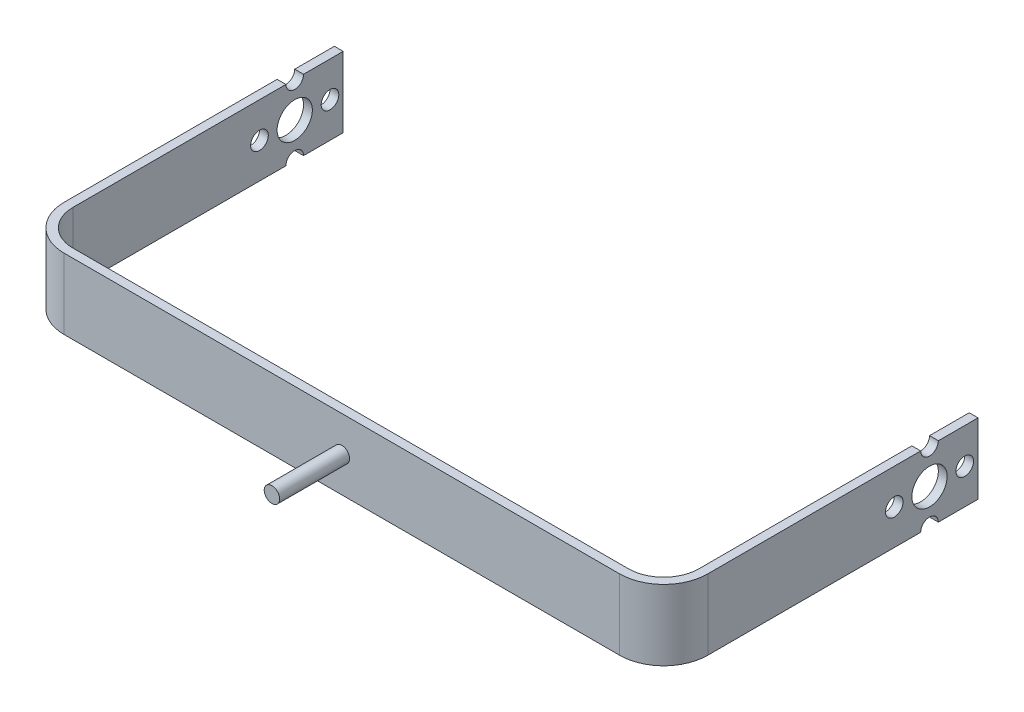
ISO-10303-21;
HEADER;
FILE_DESCRIPTION(('STEP AP214'),'2;1');
FILE_NAME('part.step','',(''),(''),'','','');
FILE_SCHEMA(('AUTOMOTIVE_DESIGN { 1 0 10303 214 1 1 1 1 }'));
ENDSEC;
DATA;
#1=APPLICATION_CONTEXT('core data for automotive mechanical design processes');
#2=APPLICATION_PROTOCOL_DEFINITION('international standard','automotive_design',2000,#1);
#3=PRODUCT_CONTEXT('',#1,'mechanical');
#4=PRODUCT('Part','Part','',(#3));
#5=PRODUCT_RELATED_PRODUCT_CATEGORY('part','',(#4));
#6=PRODUCT_DEFINITION_FORMATION('','',#4);
#7=PRODUCT_DEFINITION_CONTEXT('part definition',#1,'design');
#8=PRODUCT_DEFINITION('design','',#6,#7);
#9=PRODUCT_DEFINITION_SHAPE('','',#8);
#10=(LENGTH_UNIT() NAMED_UNIT(*) SI_UNIT(.MILLI.,.METRE.));
#11=(NAMED_UNIT(*) PLANE_ANGLE_UNIT() SI_UNIT($,.RADIAN.));
#12=(NAMED_UNIT(*) SI_UNIT($,.STERADIAN.) SOLID_ANGLE_UNIT());
#13=UNCERTAINTY_MEASURE_WITH_UNIT(LENGTH_MEASURE(1.E-05),#10,'distance_accuracy_value','');
#14=(GEOMETRIC_REPRESENTATION_CONTEXT(3) GLOBAL_UNCERTAINTY_ASSIGNED_CONTEXT((#13)) GLOBAL_UNIT_ASSIGNED_CONTEXT((#10,
#11,#12)) REPRESENTATION_CONTEXT('',''));
#15=CARTESIAN_POINT('',(0.,0.,0.));
#16=DIRECTION('',(0.,0.,1.));
#17=DIRECTION('',(1.,0.,0.));
#18=AXIS2_PLACEMENT_3D('',#15,#16,#17);
#19=CARTESIAN_POINT('',(144.05,16.,1.99999999999998));
#20=DIRECTION('',(0.,0.,-1.));
#21=DIRECTION('',(-1.,0.,0.));
#22=AXIS2_PLACEMENT_3D('',#19,#20,#21);
#23=PLANE('',#22);
#24=DIRECTION('',(1.,0.,0.));
#25=VECTOR('',#24,1.);
#26=CARTESIAN_POINT('',(144.05,16.,1.99999999999998));
#27=LINE('',#26,#25);
#28=CARTESIAN_POINT('',(8.00000000000001,16.,1.99999999999999));
#29=VERTEX_POINT('',#28);
#30=CARTESIAN_POINT('',(134.05,16.,1.99999999999998));
#31=VERTEX_POINT('',#30);
#32=EDGE_CURVE('E196',#29,#31,#27,.T.);
#33=ORIENTED_EDGE('',*,*,#32,.F.);
#34=DIRECTION('',(0.,-1.,0.));
#35=VECTOR('',#34,1.);
#36=CARTESIAN_POINT('',(8.00000000000001,16.,1.99999999999999));
#37=LINE('',#36,#35);
#38=CARTESIAN_POINT('',(8.00000000000001,0.,1.99999999999999));
#39=VERTEX_POINT('',#38);
#40=EDGE_CURVE('E267',#29,#39,#37,.T.);
#41=ORIENTED_EDGE('',*,*,#40,.T.);
#42=DIRECTION('',(1.,0.,0.));
#43=VECTOR('',#42,1.);
#44=CARTESIAN_POINT('',(144.05,0.,1.99999999999998));
#45=LINE('',#44,#43);
#46=CARTESIAN_POINT('',(134.05,0.,1.99999999999998));
#47=VERTEX_POINT('',#46);
#48=EDGE_CURVE('E217',#39,#47,#45,.T.);
#49=ORIENTED_EDGE('',*,*,#48,.T.);
#50=DIRECTION('',(0.,-1.,0.));
#51=VECTOR('',#50,1.);
#52=CARTESIAN_POINT('',(134.05,16.,1.99999999999998));
#53=LINE('',#52,#51);
#54=EDGE_CURVE('E265',#47,#31,#53,.F.);
#55=ORIENTED_EDGE('',*,*,#54,.T.);
#56=EDGE_LOOP('',(#33,#41,#49,#55));
#57=FACE_BOUND('',#56,.T.);
#58=CARTESIAN_POINT('',(71.025,8.,1.99999999999999));
#59=DIRECTION('',(0.,0.,-1.));
#60=DIRECTION('',(-1.,0.,0.));
#61=AXIS2_PLACEMENT_3D('',#58,#59,#60);
#62=CIRCLE('',#61,1.75);
#63=CARTESIAN_POINT('',(69.275,8.,1.99999999999999));
#64=VERTEX_POINT('',#63);
#65=EDGE_CURVE('E11',#64,#64,#62,.F.);
#66=ORIENTED_EDGE('',*,*,#65,.F.);
#67=EDGE_LOOP('',(#66));
#68=FACE_BOUND('',#67,.T.);
#69=ADVANCED_FACE('F32',(#57,#68),#23,.F.);
#70=CARTESIAN_POINT('',(0.,16.,0.));
#71=DIRECTION('',(0.,1.,0.));
#72=DIRECTION('',(0.,0.,1.));
#73=AXIS2_PLACEMENT_3D('',#70,#71,#72);
#74=PLANE('',#73);
#75=DIRECTION('',(1.,0.,0.));
#76=VECTOR('',#75,1.);
#77=CARTESIAN_POINT('',(-2.,16.,-56.3249999999999));
#78=LINE('',#77,#76);
#79=CARTESIAN_POINT('',(-2.,16.,-56.3249999999999));
#80=VERTEX_POINT('',#79);
#81=CARTESIAN_POINT('',(0.,16.,-56.3249999999999));
#82=VERTEX_POINT('',#81);
#83=EDGE_CURVE('E40',#80,#82,#78,.T.);
#84=ORIENTED_EDGE('',*,*,#83,.F.);
#85=DIRECTION('',(0.,0.,1.));
#86=VECTOR('',#85,1.);
#87=CARTESIAN_POINT('',(-2.,16.,2.));
#88=LINE('',#87,#86);
#89=CARTESIAN_POINT('',(-2.,16.,-8.00000000000001));
#90=VERTEX_POINT('',#89);
#91=EDGE_CURVE('E368',#80,#90,#88,.T.);
#92=ORIENTED_EDGE('',*,*,#91,.T.);
#93=CARTESIAN_POINT('',(8.00000000000001,16.,-8.00000000000001));
#94=DIRECTION('',(0.,1.,0.));
#95=DIRECTION('',(0.,0.,1.));
#96=AXIS2_PLACEMENT_3D('',#93,#94,#95);
#97=CIRCLE('',#96,10.);
#98=EDGE_CURVE('E279',#90,#29,#97,.T.);
#99=ORIENTED_EDGE('',*,*,#98,.T.);
#100=ORIENTED_EDGE('',*,*,#32,.T.);
#101=CARTESIAN_POINT('',(134.05,16.,-8.00000000000002));
#102=DIRECTION('',(0.,1.,0.));
#103=DIRECTION('',(0.,0.,1.));
#104=AXIS2_PLACEMENT_3D('',#101,#102,#103);
#105=CIRCLE('',#104,10.);
#106=CARTESIAN_POINT('',(144.05,16.,-8.00000000000002));
#107=VERTEX_POINT('',#106);
#108=EDGE_CURVE('E191',#31,#107,#105,.T.);
#109=ORIENTED_EDGE('',*,*,#108,.T.);
#110=DIRECTION('',(0.,0.,-1.));
#111=VECTOR('',#110,1.);
#112=CARTESIAN_POINT('',(144.05,16.,-69.325));
#113=LINE('',#112,#111);
#114=CARTESIAN_POINT('',(144.05,16.,-56.3249999999999));
#115=VERTEX_POINT('',#114);
#116=EDGE_CURVE('E180',#107,#115,#113,.T.);
#117=ORIENTED_EDGE('',*,*,#116,.T.);
#118=CARTESIAN_POINT('',(142.05,16.,-56.3249999999999));
#119=VERTEX_POINT('',#118);
#120=EDGE_CURVE('E167',#119,#115,#78,.T.);
#121=ORIENTED_EDGE('',*,*,#120,.F.);
#122=DIRECTION('',(0.,0.,1.));
#123=VECTOR('',#122,1.);
#124=CARTESIAN_POINT('',(142.05,16.,0.));
#125=LINE('',#124,#123);
#126=CARTESIAN_POINT('',(142.05,16.,-8.));
#127=VERTEX_POINT('',#126);
#128=EDGE_CURVE('E194',#119,#127,#125,.T.);
#129=ORIENTED_EDGE('',*,*,#128,.T.);
#130=CARTESIAN_POINT('',(134.05,16.,-8.));
#131=DIRECTION('',(0.,1.,0.));
#132=DIRECTION('',(0.,0.,1.));
#133=AXIS2_PLACEMENT_3D('',#130,#131,#132);
#134=CIRCLE('',#133,8.);
#135=CARTESIAN_POINT('',(134.05,16.,0.));
#136=VERTEX_POINT('',#135);
#137=EDGE_CURVE('E259',#127,#136,#134,.F.);
#138=ORIENTED_EDGE('',*,*,#137,.T.);
#139=DIRECTION('',(-1.,0.,0.));
#140=VECTOR('',#139,1.);
#141=CARTESIAN_POINT('',(0.,16.,0.));
#142=LINE('',#141,#140);
#143=CARTESIAN_POINT('',(8.,16.,0.));
#144=VERTEX_POINT('',#143);
#145=EDGE_CURVE('E203',#136,#144,#142,.T.);
#146=ORIENTED_EDGE('',*,*,#145,.T.);
#147=CARTESIAN_POINT('',(8.,16.,-8.));
#148=DIRECTION('',(0.,1.,0.));
#149=DIRECTION('',(0.,0.,1.));
#150=AXIS2_PLACEMENT_3D('',#147,#148,#149);
#151=CIRCLE('',#150,8.);
#152=CARTESIAN_POINT('',(0.,16.,-8.));
#153=VERTEX_POINT('',#152);
#154=EDGE_CURVE('E263',#144,#153,#151,.F.);
#155=ORIENTED_EDGE('',*,*,#154,.T.);
#156=DIRECTION('',(0.,0.,-1.));
#157=VECTOR('',#156,1.);
#158=CARTESIAN_POINT('',(0.,16.,-69.325));
#159=LINE('',#158,#157);
#160=EDGE_CURVE('E324',#153,#82,#159,.T.);
#161=ORIENTED_EDGE('',*,*,#160,.T.);
#162=EDGE_LOOP('',(#84,#92,#99,#100,#109,#117,#121,#129,#138,#146,#155,#161));
#163=FACE_BOUND('',#162,.T.);
#164=ADVANCED_FACE('F188',(#163),#74,.T.);
#165=DIRECTION('',(1.,0.,0.));
#166=VECTOR('',#165,1.);
#167=CARTESIAN_POINT('',(-2.,16.,-60.3249999999999));
#168=LINE('',#167,#166);
#169=CARTESIAN_POINT('',(144.05,16.,-60.3249999999999));
#170=VERTEX_POINT('',#169);
#171=CARTESIAN_POINT('',(142.05,16.,-60.3249999999999));
#172=VERTEX_POINT('',#171);
#173=EDGE_CURVE('E174',#170,#172,#168,.F.);
#174=ORIENTED_EDGE('',*,*,#173,.F.);
#175=CARTESIAN_POINT('',(144.05,16.,-69.325));
#176=VERTEX_POINT('',#175);
#177=EDGE_CURVE('E183',#170,#176,#113,.T.);
#178=ORIENTED_EDGE('',*,*,#177,.T.);
#179=DIRECTION('',(-1.,0.,0.));
#180=VECTOR('',#179,1.);
#181=CARTESIAN_POINT('',(142.05,16.,-69.325));
#182=LINE('',#181,#180);
#183=CARTESIAN_POINT('',(142.05,16.,-69.325));
#184=VERTEX_POINT('',#183);
#185=EDGE_CURVE('E192',#176,#184,#182,.T.);
#186=ORIENTED_EDGE('',*,*,#185,.T.);
#187=EDGE_CURVE('E200',#184,#172,#125,.T.);
#188=ORIENTED_EDGE('',*,*,#187,.T.);
#189=EDGE_LOOP('',(#174,#178,#186,#188));
#190=FACE_BOUND('',#189,.T.);
#191=ADVANCED_FACE('F399',(#190),#74,.T.);
#192=CARTESIAN_POINT('',(0.,0.,0.));
#193=DIRECTION('',(0.,1.,0.));
#194=DIRECTION('',(0.,0.,1.));
#195=AXIS2_PLACEMENT_3D('',#192,#193,#194);
#196=PLANE('',#195);
#197=DIRECTION('',(0.,0.,1.));
#198=VECTOR('',#197,1.);
#199=CARTESIAN_POINT('',(-2.,0.,2.));
#200=LINE('',#199,#198);
#201=CARTESIAN_POINT('',(-2.,0.,-56.3250000000002));
#202=VERTEX_POINT('',#201);
#203=CARTESIAN_POINT('',(-2.,0.,-8.00000000000001));
#204=VERTEX_POINT('',#203);
#205=EDGE_CURVE('E213',#202,#204,#200,.T.);
#206=ORIENTED_EDGE('',*,*,#205,.F.);
#207=DIRECTION('',(1.,0.,0.));
#208=VECTOR('',#207,1.);
#209=CARTESIAN_POINT('',(-2.,0.,-56.3250000000002));
#210=LINE('',#209,#208);
#211=CARTESIAN_POINT('',(0.,0.,-56.3250000000002));
#212=VERTEX_POINT('',#211);
#213=EDGE_CURVE('E300',#202,#212,#210,.T.);
#214=ORIENTED_EDGE('',*,*,#213,.T.);
#215=DIRECTION('',(0.,0.,-1.));
#216=VECTOR('',#215,1.);
#217=CARTESIAN_POINT('',(0.,0.,-69.325));
#218=LINE('',#217,#216);
#219=CARTESIAN_POINT('',(0.,0.,-8.));
#220=VERTEX_POINT('',#219);
#221=EDGE_CURVE('E207',#220,#212,#218,.T.);
#222=ORIENTED_EDGE('',*,*,#221,.F.);
#223=CARTESIAN_POINT('',(8.,0.,-8.));
#224=DIRECTION('',(0.,1.,0.));
#225=DIRECTION('',(0.,0.,1.));
#226=AXIS2_PLACEMENT_3D('',#223,#224,#225);
#227=CIRCLE('',#226,8.);
#228=CARTESIAN_POINT('',(8.,0.,0.));
#229=VERTEX_POINT('',#228);
#230=EDGE_CURVE('E261',#220,#229,#227,.T.);
#231=ORIENTED_EDGE('',*,*,#230,.T.);
#232=DIRECTION('',(-1.,0.,0.));
#233=VECTOR('',#232,1.);
#234=CARTESIAN_POINT('',(0.,0.,0.));
#235=LINE('',#234,#233);
#236=CARTESIAN_POINT('',(134.05,0.,0.));
#237=VERTEX_POINT('',#236);
#238=EDGE_CURVE('E230',#237,#229,#235,.T.);
#239=ORIENTED_EDGE('',*,*,#238,.F.);
#240=CARTESIAN_POINT('',(134.05,0.,-8.));
#241=DIRECTION('',(0.,1.,0.));
#242=DIRECTION('',(0.,0.,1.));
#243=AXIS2_PLACEMENT_3D('',#240,#241,#242);
#244=CIRCLE('',#243,8.);
#245=CARTESIAN_POINT('',(142.05,0.,-8.));
#246=VERTEX_POINT('',#245);
#247=EDGE_CURVE('E256',#237,#246,#244,.T.);
#248=ORIENTED_EDGE('',*,*,#247,.T.);
#249=DIRECTION('',(0.,0.,1.));
#250=VECTOR('',#249,1.);
#251=CARTESIAN_POINT('',(142.05,0.,0.));
#252=LINE('',#251,#250);
#253=CARTESIAN_POINT('',(142.05,0.,-56.3250000000002));
#254=VERTEX_POINT('',#253);
#255=EDGE_CURVE('E226',#254,#246,#252,.T.);
#256=ORIENTED_EDGE('',*,*,#255,.F.);
#257=CARTESIAN_POINT('',(144.05,0.,-56.3250000000002));
#258=VERTEX_POINT('',#257);
#259=EDGE_CURVE('E297',#254,#258,#210,.T.);
#260=ORIENTED_EDGE('',*,*,#259,.T.);
#261=DIRECTION('',(0.,0.,-1.));
#262=VECTOR('',#261,1.);
#263=CARTESIAN_POINT('',(144.05,0.,-69.325));
#264=LINE('',#263,#262);
#265=CARTESIAN_POINT('',(144.05,0.,-8.00000000000002));
#266=VERTEX_POINT('',#265);
#267=EDGE_CURVE('E221',#266,#258,#264,.T.);
#268=ORIENTED_EDGE('',*,*,#267,.F.);
#269=CARTESIAN_POINT('',(134.05,0.,-8.00000000000002));
#270=DIRECTION('',(0.,1.,0.));
#271=DIRECTION('',(0.,0.,1.));
#272=AXIS2_PLACEMENT_3D('',#269,#270,#271);
#273=CIRCLE('',#272,10.);
#274=EDGE_CURVE('E270',#266,#47,#273,.F.);
#275=ORIENTED_EDGE('',*,*,#274,.T.);
#276=ORIENTED_EDGE('',*,*,#48,.F.);
#277=CARTESIAN_POINT('',(8.00000000000001,0.,-8.00000000000001));
#278=DIRECTION('',(0.,1.,0.));
#279=DIRECTION('',(0.,0.,1.));
#280=AXIS2_PLACEMENT_3D('',#277,#278,#279);
#281=CIRCLE('',#280,10.);
#282=EDGE_CURVE('E272',#39,#204,#281,.F.);
#283=ORIENTED_EDGE('',*,*,#282,.T.);
#284=EDGE_LOOP('',(#206,#214,#222,#231,#239,#248,#256,#260,#268,#275,#276,#283));
#285=FACE_BOUND('',#284,.T.);
#286=ADVANCED_FACE('F312',(#285),#196,.F.);
#287=CARTESIAN_POINT('',(144.05,0.,-60.3250000000002));
#288=VERTEX_POINT('',#287);
#289=CARTESIAN_POINT('',(144.05,0.,-69.325));
#290=VERTEX_POINT('',#289);
#291=EDGE_CURVE('E220',#288,#290,#264,.T.);
#292=ORIENTED_EDGE('',*,*,#291,.F.);
#293=DIRECTION('',(1.,0.,0.));
#294=VECTOR('',#293,1.);
#295=CARTESIAN_POINT('',(-2.,0.,-60.3250000000002));
#296=LINE('',#295,#294);
#297=CARTESIAN_POINT('',(142.05,0.,-60.3250000000002));
#298=VERTEX_POINT('',#297);
#299=EDGE_CURVE('E296',#288,#298,#296,.F.);
#300=ORIENTED_EDGE('',*,*,#299,.T.);
#301=CARTESIAN_POINT('',(142.05,0.,-69.325));
#302=VERTEX_POINT('',#301);
#303=EDGE_CURVE('E227',#302,#298,#252,.T.);
#304=ORIENTED_EDGE('',*,*,#303,.F.);
#305=DIRECTION('',(-1.,0.,0.));
#306=VECTOR('',#305,1.);
#307=CARTESIAN_POINT('',(142.05,0.,-69.325));
#308=LINE('',#307,#306);
#309=EDGE_CURVE('E224',#290,#302,#308,.T.);
#310=ORIENTED_EDGE('',*,*,#309,.F.);
#311=EDGE_LOOP('',(#292,#300,#304,#310));
#312=FACE_BOUND('',#311,.T.);
#313=ADVANCED_FACE('F392',(#312),#196,.F.);
#314=CARTESIAN_POINT('',(0.,16.,-69.325));
#315=DIRECTION('',(-1.,0.,0.));
#316=DIRECTION('',(0.,0.,1.));
#317=AXIS2_PLACEMENT_3D('',#314,#315,#316);
#318=PLANE('',#317);
#319=CARTESIAN_POINT('',(0.,7.99999999999961,-50.325));
#320=DIRECTION('',(-1.,0.,0.));
#321=DIRECTION('',(0.,0.,1.));
#322=AXIS2_PLACEMENT_3D('',#319,#320,#321);
#323=CIRCLE('',#322,1.99999999999999);
#324=CARTESIAN_POINT('',(0.,7.99999999999961,-48.325));
#325=VERTEX_POINT('',#324);
#326=EDGE_CURVE('E304',#325,#325,#323,.T.);
#327=ORIENTED_EDGE('',*,*,#326,.T.);
#328=EDGE_LOOP('',(#327));
#329=FACE_BOUND('',#328,.T.);
#330=CARTESIAN_POINT('',(0.,8.,-66.325));
#331=DIRECTION('',(-1.,0.,0.));
#332=DIRECTION('',(0.,0.,1.));
#333=AXIS2_PLACEMENT_3D('',#330,#331,#332);
#334=CIRCLE('',#333,2.);
#335=CARTESIAN_POINT('',(0.,8.,-64.325));
#336=VERTEX_POINT('',#335);
#337=EDGE_CURVE('E292',#336,#336,#334,.T.);
#338=ORIENTED_EDGE('',*,*,#337,.T.);
#339=EDGE_LOOP('',(#338));
#340=FACE_BOUND('',#339,.T.);
#341=CARTESIAN_POINT('',(0.,8.,-58.325));
#342=DIRECTION('',(-1.,0.,0.));
#343=DIRECTION('',(0.,0.,1.));
#344=AXIS2_PLACEMENT_3D('',#341,#342,#343);
#345=CIRCLE('',#344,4.);
#346=CARTESIAN_POINT('',(0.,8.,-54.325));
#347=VERTEX_POINT('',#346);
#348=EDGE_CURVE('E287',#347,#347,#345,.T.);
#349=ORIENTED_EDGE('',*,*,#348,.T.);
#350=EDGE_LOOP('',(#349));
#351=FACE_BOUND('',#350,.T.);
#352=CARTESIAN_POINT('',(0.,16.,-60.3249999999999));
#353=VERTEX_POINT('',#352);
#354=CARTESIAN_POINT('',(0.,16.,-69.325));
#355=VERTEX_POINT('',#354);
#356=EDGE_CURVE('E233',#353,#355,#159,.T.);
#357=ORIENTED_EDGE('',*,*,#356,.F.);
#358=CARTESIAN_POINT('',(0.,15.9999999999998,-58.3249999999999));
#359=DIRECTION('',(-1.,0.,0.));
#360=DIRECTION('',(0.,0.,1.));
#361=AXIS2_PLACEMENT_3D('',#358,#359,#360);
#362=CIRCLE('',#361,1.99999999999999);
#363=EDGE_CURVE('E47',#353,#82,#362,.T.);
#364=ORIENTED_EDGE('',*,*,#363,.T.);
#365=ORIENTED_EDGE('',*,*,#160,.F.);
#366=DIRECTION('',(0.,-1.,0.));
#367=VECTOR('',#366,1.);
#368=CARTESIAN_POINT('',(0.,0.,-8.));
#369=LINE('',#368,#367);
#370=EDGE_CURVE('E253',#153,#220,#369,.T.);
#371=ORIENTED_EDGE('',*,*,#370,.T.);
#372=ORIENTED_EDGE('',*,*,#221,.T.);
#373=CARTESIAN_POINT('',(0.,-2.22044604925031E-13,-58.3250000000002));
#374=DIRECTION('',(-1.,0.,0.));
#375=DIRECTION('',(0.,0.,1.));
#376=AXIS2_PLACEMENT_3D('',#373,#374,#375);
#377=CIRCLE('',#376,1.99999999999999);
#378=CARTESIAN_POINT('',(0.,0.,-60.3250000000002));
#379=VERTEX_POINT('',#378);
#380=EDGE_CURVE('E319',#212,#379,#377,.T.);
#381=ORIENTED_EDGE('',*,*,#380,.T.);
#382=CARTESIAN_POINT('',(0.,0.,-69.325));
#383=VERTEX_POINT('',#382);
#384=EDGE_CURVE('E211',#379,#383,#218,.T.);
#385=ORIENTED_EDGE('',*,*,#384,.T.);
#386=DIRECTION('',(0.,-1.,0.));
#387=VECTOR('',#386,1.);
#388=CARTESIAN_POINT('',(0.,16.,-69.325));
#389=LINE('',#388,#387);
#390=EDGE_CURVE('E242',#355,#383,#389,.T.);
#391=ORIENTED_EDGE('',*,*,#390,.F.);
#392=EDGE_LOOP('',(#357,#364,#365,#371,#372,#381,#385,#391));
#393=FACE_BOUND('',#392,.T.);
#394=ADVANCED_FACE('F318',(#329,#340,#351,#393),#318,.F.);
#395=CARTESIAN_POINT('',(-2.,16.,-69.325));
#396=DIRECTION('',(0.,0.,1.));
#397=DIRECTION('',(1.,0.,0.));
#398=AXIS2_PLACEMENT_3D('',#395,#396,#397);
#399=PLANE('',#398);
#400=DIRECTION('',(-1.,0.,0.));
#401=VECTOR('',#400,1.);
#402=CARTESIAN_POINT('',(-2.,0.,-69.325));
#403=LINE('',#402,#401);
#404=CARTESIAN_POINT('',(-2.,0.,-69.325));
#405=VERTEX_POINT('',#404);
#406=EDGE_CURVE('E210',#383,#405,#403,.T.);
#407=ORIENTED_EDGE('',*,*,#406,.T.);
#408=DIRECTION('',(0.,-1.,0.));
#409=VECTOR('',#408,1.);
#410=CARTESIAN_POINT('',(-2.,16.,-69.325));
#411=LINE('',#410,#409);
#412=CARTESIAN_POINT('',(-2.,16.,-69.325));
#413=VERTEX_POINT('',#412);
#414=EDGE_CURVE('E239',#413,#405,#411,.T.);
#415=ORIENTED_EDGE('',*,*,#414,.F.);
#416=DIRECTION('',(-1.,0.,0.));
#417=VECTOR('',#416,1.);
#418=CARTESIAN_POINT('',(-2.,16.,-69.325));
#419=LINE('',#418,#417);
#420=EDGE_CURVE('E367',#355,#413,#419,.T.);
#421=ORIENTED_EDGE('',*,*,#420,.F.);
#422=ORIENTED_EDGE('',*,*,#390,.T.);
#423=EDGE_LOOP('',(#407,#415,#421,#422));
#424=FACE_BOUND('',#423,.T.);
#425=ADVANCED_FACE('F420',(#424),#399,.F.);
#426=CARTESIAN_POINT('',(-2.,16.,2.));
#427=DIRECTION('',(1.,0.,0.));
#428=DIRECTION('',(0.,0.,-1.));
#429=AXIS2_PLACEMENT_3D('',#426,#427,#428);
#430=PLANE('',#429);
#431=CARTESIAN_POINT('',(-2.,7.99999999999961,-50.325));
#432=DIRECTION('',(1.,0.,0.));
#433=DIRECTION('',(0.,0.,-1.));
#434=AXIS2_PLACEMENT_3D('',#431,#432,#433);
#435=CIRCLE('',#434,1.99999999999999);
#436=CARTESIAN_POINT('',(-2.,7.99999999999961,-52.325));
#437=VERTEX_POINT('',#436);
#438=EDGE_CURVE('E305',#437,#437,#435,.T.);
#439=ORIENTED_EDGE('',*,*,#438,.T.);
#440=EDGE_LOOP('',(#439));
#441=FACE_BOUND('',#440,.T.);
#442=CARTESIAN_POINT('',(-2.,8.,-66.325));
#443=DIRECTION('',(1.,0.,0.));
#444=DIRECTION('',(0.,0.,-1.));
#445=AXIS2_PLACEMENT_3D('',#442,#443,#444);
#446=CIRCLE('',#445,2.);
#447=CARTESIAN_POINT('',(-2.,8.,-68.325));
#448=VERTEX_POINT('',#447);
#449=EDGE_CURVE('E293',#448,#448,#446,.T.);
#450=ORIENTED_EDGE('',*,*,#449,.T.);
#451=EDGE_LOOP('',(#450));
#452=FACE_BOUND('',#451,.T.);
#453=CARTESIAN_POINT('',(-2.,8.,-58.325));
#454=DIRECTION('',(1.,0.,0.));
#455=DIRECTION('',(0.,0.,-1.));
#456=AXIS2_PLACEMENT_3D('',#453,#454,#455);
#457=CIRCLE('',#456,4.);
#458=CARTESIAN_POINT('',(-2.,8.,-62.325));
#459=VERTEX_POINT('',#458);
#460=EDGE_CURVE('E288',#459,#459,#457,.T.);
#461=ORIENTED_EDGE('',*,*,#460,.T.);
#462=EDGE_LOOP('',(#461));
#463=FACE_BOUND('',#462,.T.);
#464=ORIENTED_EDGE('',*,*,#91,.F.);
#465=CARTESIAN_POINT('',(-2.,15.9999999999998,-58.3249999999999));
#466=DIRECTION('',(1.,0.,0.));
#467=DIRECTION('',(0.,0.,-1.));
#468=AXIS2_PLACEMENT_3D('',#465,#466,#467);
#469=CIRCLE('',#468,1.99999999999999);
#470=CARTESIAN_POINT('',(-2.,16.,-60.3249999999999));
#471=VERTEX_POINT('',#470);
#472=EDGE_CURVE('E184',#80,#471,#469,.T.);
#473=ORIENTED_EDGE('',*,*,#472,.T.);
#474=EDGE_CURVE('E369',#413,#471,#88,.T.);
#475=ORIENTED_EDGE('',*,*,#474,.F.);
#476=ORIENTED_EDGE('',*,*,#414,.T.);
#477=CARTESIAN_POINT('',(-2.,0.,-60.3250000000002));
#478=VERTEX_POINT('',#477);
#479=EDGE_CURVE('E214',#405,#478,#200,.T.);
#480=ORIENTED_EDGE('',*,*,#479,.T.);
#481=CARTESIAN_POINT('',(-2.,-2.22044604925031E-13,-58.3250000000002));
#482=DIRECTION('',(1.,0.,0.));
#483=DIRECTION('',(0.,0.,-1.));
#484=AXIS2_PLACEMENT_3D('',#481,#482,#483);
#485=CIRCLE('',#484,1.99999999999999);
#486=EDGE_CURVE('E351',#478,#202,#485,.T.);
#487=ORIENTED_EDGE('',*,*,#486,.T.);
#488=ORIENTED_EDGE('',*,*,#205,.T.);
#489=DIRECTION('',(0.,-1.,0.));
#490=VECTOR('',#489,1.);
#491=CARTESIAN_POINT('',(-2.,16.,-8.00000000000001));
#492=LINE('',#491,#490);
#493=EDGE_CURVE('E275',#204,#90,#492,.F.);
#494=ORIENTED_EDGE('',*,*,#493,.T.);
#495=EDGE_LOOP('',(#464,#473,#475,#476,#480,#487,#488,#494));
#496=FACE_BOUND('',#495,.T.);
#497=ADVANCED_FACE('F378',(#441,#452,#463,#496),#430,.F.);
#498=CARTESIAN_POINT('',(144.05,16.,-69.325));
#499=DIRECTION('',(-1.,0.,0.));
#500=DIRECTION('',(0.,0.,1.));
#501=AXIS2_PLACEMENT_3D('',#498,#499,#500);
#502=PLANE('',#501);
#503=CARTESIAN_POINT('',(144.05,7.99999999999961,-50.325));
#504=DIRECTION('',(1.,0.,0.));
#505=DIRECTION('',(0.,0.,-1.));
#506=AXIS2_PLACEMENT_3D('',#503,#504,#505);
#507=CIRCLE('',#506,1.99999999999999);
#508=CARTESIAN_POINT('',(144.05,7.99999999999961,-52.325));
#509=VERTEX_POINT('',#508);
#510=EDGE_CURVE('E480',#509,#509,#507,.T.);
#511=ORIENTED_EDGE('',*,*,#510,.F.);
#512=EDGE_LOOP('',(#511));
#513=FACE_BOUND('',#512,.T.);
#514=CARTESIAN_POINT('',(144.05,8.,-66.325));
#515=DIRECTION('',(1.,0.,0.));
#516=DIRECTION('',(0.,0.,-1.));
#517=AXIS2_PLACEMENT_3D('',#514,#515,#516);
#518=CIRCLE('',#517,2.);
#519=CARTESIAN_POINT('',(144.05,8.,-68.325));
#520=VERTEX_POINT('',#519);
#521=EDGE_CURVE('E347',#520,#520,#518,.T.);
#522=ORIENTED_EDGE('',*,*,#521,.F.);
#523=EDGE_LOOP('',(#522));
#524=FACE_BOUND('',#523,.T.);
#525=CARTESIAN_POINT('',(144.05,8.,-58.325));
#526=DIRECTION('',(1.,0.,0.));
#527=DIRECTION('',(0.,0.,-1.));
#528=AXIS2_PLACEMENT_3D('',#525,#526,#527);
#529=CIRCLE('',#528,4.);
#530=CARTESIAN_POINT('',(144.05,8.,-62.325));
#531=VERTEX_POINT('',#530);
#532=EDGE_CURVE('E359',#531,#531,#529,.T.);
#533=ORIENTED_EDGE('',*,*,#532,.F.);
#534=EDGE_LOOP('',(#533));
#535=FACE_BOUND('',#534,.T.);
#536=ORIENTED_EDGE('',*,*,#177,.F.);
#537=CARTESIAN_POINT('',(144.05,15.9999999999998,-58.3249999999999));
#538=DIRECTION('',(1.,0.,0.));
#539=DIRECTION('',(0.,0.,-1.));
#540=AXIS2_PLACEMENT_3D('',#537,#538,#539);
#541=CIRCLE('',#540,1.99999999999999);
#542=EDGE_CURVE('E55',#115,#170,#541,.T.);
#543=ORIENTED_EDGE('',*,*,#542,.F.);
#544=ORIENTED_EDGE('',*,*,#116,.F.);
#545=DIRECTION('',(0.,-1.,0.));
#546=VECTOR('',#545,1.);
#547=CARTESIAN_POINT('',(144.05,16.,-8.00000000000002));
#548=LINE('',#547,#546);
#549=EDGE_CURVE('E281',#107,#266,#548,.T.);
#550=ORIENTED_EDGE('',*,*,#549,.T.);
#551=ORIENTED_EDGE('',*,*,#267,.T.);
#552=CARTESIAN_POINT('',(144.05,-2.22044604925031E-13,-58.3250000000002));
#553=DIRECTION('',(1.,0.,0.));
#554=DIRECTION('',(0.,0.,-1.));
#555=AXIS2_PLACEMENT_3D('',#552,#553,#554);
#556=CIRCLE('',#555,1.99999999999999);
#557=EDGE_CURVE('E388',#288,#258,#556,.T.);
#558=ORIENTED_EDGE('',*,*,#557,.F.);
#559=ORIENTED_EDGE('',*,*,#291,.T.);
#560=DIRECTION('',(0.,-1.,0.));
#561=VECTOR('',#560,1.);
#562=CARTESIAN_POINT('',(144.05,16.,-69.325));
#563=LINE('',#562,#561);
#564=EDGE_CURVE('E236',#176,#290,#563,.T.);
#565=ORIENTED_EDGE('',*,*,#564,.F.);
#566=EDGE_LOOP('',(#536,#543,#544,#550,#551,#558,#559,#565));
#567=FACE_BOUND('',#566,.T.);
#568=ADVANCED_FACE('F178',(#513,#524,#535,#567),#502,.F.);
#569=CARTESIAN_POINT('',(142.05,16.,-69.325));
#570=DIRECTION('',(0.,0.,1.));
#571=DIRECTION('',(1.,0.,0.));
#572=AXIS2_PLACEMENT_3D('',#569,#570,#571);
#573=PLANE('',#572);
#574=ORIENTED_EDGE('',*,*,#309,.T.);
#575=DIRECTION('',(0.,-1.,0.));
#576=VECTOR('',#575,1.);
#577=CARTESIAN_POINT('',(142.05,16.,-69.325));
#578=LINE('',#577,#576);
#579=EDGE_CURVE('E206',#184,#302,#578,.T.);
#580=ORIENTED_EDGE('',*,*,#579,.F.);
#581=ORIENTED_EDGE('',*,*,#185,.F.);
#582=ORIENTED_EDGE('',*,*,#564,.T.);
#583=EDGE_LOOP('',(#574,#580,#581,#582));
#584=FACE_BOUND('',#583,.T.);
#585=ADVANCED_FACE('F395',(#584),#573,.F.);
#586=CARTESIAN_POINT('',(142.05,16.,0.));
#587=DIRECTION('',(1.,0.,0.));
#588=DIRECTION('',(0.,0.,-1.));
#589=AXIS2_PLACEMENT_3D('',#586,#587,#588);
#590=PLANE('',#589);
#591=CARTESIAN_POINT('',(142.05,7.99999999999961,-50.325));
#592=DIRECTION('',(1.,0.,0.));
#593=DIRECTION('',(0.,0.,-1.));
#594=AXIS2_PLACEMENT_3D('',#591,#592,#593);
#595=CIRCLE('',#594,1.99999999999999);
#596=CARTESIAN_POINT('',(142.05,7.99999999999961,-52.325));
#597=VERTEX_POINT('',#596);
#598=EDGE_CURVE('E301',#597,#597,#595,.T.);
#599=ORIENTED_EDGE('',*,*,#598,.T.);
#600=EDGE_LOOP('',(#599));
#601=FACE_BOUND('',#600,.T.);
#602=CARTESIAN_POINT('',(142.05,8.,-66.325));
#603=DIRECTION('',(1.,0.,0.));
#604=DIRECTION('',(0.,0.,-1.));
#605=AXIS2_PLACEMENT_3D('',#602,#603,#604);
#606=CIRCLE('',#605,2.);
#607=CARTESIAN_POINT('',(142.05,8.,-68.325));
#608=VERTEX_POINT('',#607);
#609=EDGE_CURVE('E289',#608,#608,#606,.T.);
#610=ORIENTED_EDGE('',*,*,#609,.T.);
#611=EDGE_LOOP('',(#610));
#612=FACE_BOUND('',#611,.T.);
#613=CARTESIAN_POINT('',(142.05,8.,-58.325));
#614=DIRECTION('',(1.,0.,0.));
#615=DIRECTION('',(0.,0.,-1.));
#616=AXIS2_PLACEMENT_3D('',#613,#614,#615);
#617=CIRCLE('',#616,4.);
#618=CARTESIAN_POINT('',(142.05,8.,-62.325));
#619=VERTEX_POINT('',#618);
#620=EDGE_CURVE('E284',#619,#619,#617,.T.);
#621=ORIENTED_EDGE('',*,*,#620,.T.);
#622=EDGE_LOOP('',(#621));
#623=FACE_BOUND('',#622,.T.);
#624=ORIENTED_EDGE('',*,*,#128,.F.);
#625=CARTESIAN_POINT('',(142.05,15.9999999999998,-58.3249999999999));
#626=DIRECTION('',(1.,0.,0.));
#627=DIRECTION('',(0.,0.,-1.));
#628=AXIS2_PLACEMENT_3D('',#625,#626,#627);
#629=CIRCLE('',#628,1.99999999999999);
#630=EDGE_CURVE('E170',#119,#172,#629,.T.);
#631=ORIENTED_EDGE('',*,*,#630,.T.);
#632=ORIENTED_EDGE('',*,*,#187,.F.);
#633=ORIENTED_EDGE('',*,*,#579,.T.);
#634=ORIENTED_EDGE('',*,*,#303,.T.);
#635=CARTESIAN_POINT('',(142.05,-2.22044604925031E-13,-58.3250000000002));
#636=DIRECTION('',(1.,0.,0.));
#637=DIRECTION('',(0.,0.,-1.));
#638=AXIS2_PLACEMENT_3D('',#635,#636,#637);
#639=CIRCLE('',#638,1.99999999999999);
#640=EDGE_CURVE('E343',#298,#254,#639,.T.);
#641=ORIENTED_EDGE('',*,*,#640,.T.);
#642=ORIENTED_EDGE('',*,*,#255,.T.);
#643=DIRECTION('',(0.,-1.,0.));
#644=VECTOR('',#643,1.);
#645=CARTESIAN_POINT('',(142.05,16.,-8.));
#646=LINE('',#645,#644);
#647=EDGE_CURVE('E250',#246,#127,#646,.F.);
#648=ORIENTED_EDGE('',*,*,#647,.T.);
#649=EDGE_LOOP('',(#624,#631,#632,#633,#634,#641,#642,#648));
#650=FACE_BOUND('',#649,.T.);
#651=ADVANCED_FACE('F342',(#601,#612,#623,#650),#590,.F.);
#652=CARTESIAN_POINT('',(0.,16.,0.));
#653=DIRECTION('',(0.,0.,1.));
#654=DIRECTION('',(1.,0.,0.));
#655=AXIS2_PLACEMENT_3D('',#652,#653,#654);
#656=PLANE('',#655);
#657=ORIENTED_EDGE('',*,*,#145,.F.);
#658=DIRECTION('',(0.,-1.,0.));
#659=VECTOR('',#658,1.);
#660=CARTESIAN_POINT('',(134.05,0.,0.));
#661=LINE('',#660,#659);
#662=EDGE_CURVE('E247',#136,#237,#661,.T.);
#663=ORIENTED_EDGE('',*,*,#662,.T.);
#664=ORIENTED_EDGE('',*,*,#238,.T.);
#665=DIRECTION('',(0.,-1.,0.));
#666=VECTOR('',#665,1.);
#667=CARTESIAN_POINT('',(8.,16.,0.));
#668=LINE('',#667,#666);
#669=EDGE_CURVE('E245',#229,#144,#668,.F.);
#670=ORIENTED_EDGE('',*,*,#669,.T.);
#671=EDGE_LOOP('',(#657,#663,#664,#670));
#672=FACE_BOUND('',#671,.T.);
#673=ADVANCED_FACE('F332',(#672),#656,.F.);
#674=EDGE_CURVE('E306',#353,#471,#168,.F.);
#675=ORIENTED_EDGE('',*,*,#674,.F.);
#676=ORIENTED_EDGE('',*,*,#356,.T.);
#677=ORIENTED_EDGE('',*,*,#420,.T.);
#678=ORIENTED_EDGE('',*,*,#474,.T.);
#679=EDGE_LOOP('',(#675,#676,#677,#678));
#680=FACE_BOUND('',#679,.T.);
#681=ADVANCED_FACE('F402',(#680),#74,.T.);
#682=ORIENTED_EDGE('',*,*,#384,.F.);
#683=EDGE_CURVE('E283',#379,#478,#296,.F.);
#684=ORIENTED_EDGE('',*,*,#683,.T.);
#685=ORIENTED_EDGE('',*,*,#479,.F.);
#686=ORIENTED_EDGE('',*,*,#406,.F.);
#687=EDGE_LOOP('',(#682,#684,#685,#686));
#688=FACE_BOUND('',#687,.T.);
#689=ADVANCED_FACE('F408',(#688),#196,.F.);
#690=CARTESIAN_POINT('',(134.05,16.,-8.));
#691=DIRECTION('',(0.,1.,0.));
#692=DIRECTION('',(0.,0.,1.));
#693=AXIS2_PLACEMENT_3D('',#690,#691,#692);
#694=CYLINDRICAL_SURFACE('',#693,8.);
#695=ORIENTED_EDGE('',*,*,#137,.F.);
#696=ORIENTED_EDGE('',*,*,#647,.F.);
#697=ORIENTED_EDGE('',*,*,#247,.F.);
#698=ORIENTED_EDGE('',*,*,#662,.F.);
#699=EDGE_LOOP('',(#695,#696,#697,#698));
#700=FACE_BOUND('',#699,.T.);
#701=ADVANCED_FACE('F336',(#700),#694,.F.);
#702=CARTESIAN_POINT('',(8.,16.,-8.));
#703=DIRECTION('',(0.,1.,0.));
#704=DIRECTION('',(0.,0.,1.));
#705=AXIS2_PLACEMENT_3D('',#702,#703,#704);
#706=CYLINDRICAL_SURFACE('',#705,8.);
#707=ORIENTED_EDGE('',*,*,#154,.F.);
#708=ORIENTED_EDGE('',*,*,#669,.F.);
#709=ORIENTED_EDGE('',*,*,#230,.F.);
#710=ORIENTED_EDGE('',*,*,#370,.F.);
#711=EDGE_LOOP('',(#707,#708,#709,#710));
#712=FACE_BOUND('',#711,.T.);
#713=ADVANCED_FACE('F327',(#712),#706,.F.);
#714=CARTESIAN_POINT('',(8.00000000000001,16.,-8.00000000000001));
#715=DIRECTION('',(0.,-1.,0.));
#716=DIRECTION('',(0.,0.,-1.));
#717=AXIS2_PLACEMENT_3D('',#714,#715,#716);
#718=CYLINDRICAL_SURFACE('',#717,10.);
#719=ORIENTED_EDGE('',*,*,#98,.F.);
#720=ORIENTED_EDGE('',*,*,#493,.F.);
#721=ORIENTED_EDGE('',*,*,#282,.F.);
#722=ORIENTED_EDGE('',*,*,#40,.F.);
#723=EDGE_LOOP('',(#719,#720,#721,#722));
#724=FACE_BOUND('',#723,.T.);
#725=ADVANCED_FACE('F381',(#724),#718,.T.);
#726=CARTESIAN_POINT('',(134.05,16.,-8.00000000000002));
#727=DIRECTION('',(0.,-1.,0.));
#728=DIRECTION('',(0.,0.,-1.));
#729=AXIS2_PLACEMENT_3D('',#726,#727,#728);
#730=CYLINDRICAL_SURFACE('',#729,10.);
#731=ORIENTED_EDGE('',*,*,#108,.F.);
#732=ORIENTED_EDGE('',*,*,#54,.F.);
#733=ORIENTED_EDGE('',*,*,#274,.F.);
#734=ORIENTED_EDGE('',*,*,#549,.F.);
#735=EDGE_LOOP('',(#731,#732,#733,#734));
#736=FACE_BOUND('',#735,.T.);
#737=ADVANCED_FACE('F34',(#736),#730,.T.);
#738=CARTESIAN_POINT('',(-2.,8.,-58.325));
#739=DIRECTION('',(1.,0.,0.));
#740=DIRECTION('',(0.,0.,-1.));
#741=AXIS2_PLACEMENT_3D('',#738,#739,#740);
#742=CYLINDRICAL_SURFACE('',#741,4.);
#743=ORIENTED_EDGE('',*,*,#532,.T.);
#744=EDGE_LOOP('',(#743));
#745=FACE_BOUND('',#744,.T.);
#746=ORIENTED_EDGE('',*,*,#620,.F.);
#747=EDGE_LOOP('',(#746));
#748=FACE_BOUND('',#747,.T.);
#749=ADVANCED_FACE('F435',(#745,#748),#742,.F.);
#750=ORIENTED_EDGE('',*,*,#460,.F.);
#751=EDGE_LOOP('',(#750));
#752=FACE_BOUND('',#751,.T.);
#753=ORIENTED_EDGE('',*,*,#348,.F.);
#754=EDGE_LOOP('',(#753));
#755=FACE_BOUND('',#754,.T.);
#756=ADVANCED_FACE('F439',(#752,#755),#742,.F.);
#757=CARTESIAN_POINT('',(-2.,8.,-66.325));
#758=DIRECTION('',(1.,0.,0.));
#759=DIRECTION('',(0.,0.,-1.));
#760=AXIS2_PLACEMENT_3D('',#757,#758,#759);
#761=CYLINDRICAL_SURFACE('',#760,2.);
#762=ORIENTED_EDGE('',*,*,#521,.T.);
#763=EDGE_LOOP('',(#762));
#764=FACE_BOUND('',#763,.T.);
#765=ORIENTED_EDGE('',*,*,#609,.F.);
#766=EDGE_LOOP('',(#765));
#767=FACE_BOUND('',#766,.T.);
#768=ADVANCED_FACE('F444',(#764,#767),#761,.F.);
#769=ORIENTED_EDGE('',*,*,#449,.F.);
#770=EDGE_LOOP('',(#769));
#771=FACE_BOUND('',#770,.T.);
#772=ORIENTED_EDGE('',*,*,#337,.F.);
#773=EDGE_LOOP('',(#772));
#774=FACE_BOUND('',#773,.T.);
#775=ADVANCED_FACE('F448',(#771,#774),#761,.F.);
#776=CARTESIAN_POINT('',(-2.,-2.22044604925031E-13,-58.3250000000002));
#777=DIRECTION('',(1.,0.,0.));
#778=DIRECTION('',(0.,0.,-1.));
#779=AXIS2_PLACEMENT_3D('',#776,#777,#778);
#780=CYLINDRICAL_SURFACE('',#779,1.99999999999999);
#781=ORIENTED_EDGE('',*,*,#486,.F.);
#782=ORIENTED_EDGE('',*,*,#683,.F.);
#783=ORIENTED_EDGE('',*,*,#380,.F.);
#784=ORIENTED_EDGE('',*,*,#213,.F.);
#785=EDGE_LOOP('',(#781,#782,#783,#784));
#786=FACE_BOUND('',#785,.T.);
#787=ADVANCED_FACE('F451',(#786),#780,.F.);
#788=ORIENTED_EDGE('',*,*,#640,.F.);
#789=ORIENTED_EDGE('',*,*,#299,.F.);
#790=ORIENTED_EDGE('',*,*,#557,.T.);
#791=ORIENTED_EDGE('',*,*,#259,.F.);
#792=EDGE_LOOP('',(#788,#789,#790,#791));
#793=FACE_BOUND('',#792,.T.);
#794=ADVANCED_FACE('F453',(#793),#780,.F.);
#795=CARTESIAN_POINT('',(-2.,7.99999999999961,-50.325));
#796=DIRECTION('',(1.,0.,0.));
#797=DIRECTION('',(0.,0.,-1.));
#798=AXIS2_PLACEMENT_3D('',#795,#796,#797);
#799=CYLINDRICAL_SURFACE('',#798,1.99999999999999);
#800=ORIENTED_EDGE('',*,*,#510,.T.);
#801=EDGE_LOOP('',(#800));
#802=FACE_BOUND('',#801,.T.);
#803=ORIENTED_EDGE('',*,*,#598,.F.);
#804=EDGE_LOOP('',(#803));
#805=FACE_BOUND('',#804,.T.);
#806=ADVANCED_FACE('F456',(#802,#805),#799,.F.);
#807=ORIENTED_EDGE('',*,*,#438,.F.);
#808=EDGE_LOOP('',(#807));
#809=FACE_BOUND('',#808,.T.);
#810=ORIENTED_EDGE('',*,*,#326,.F.);
#811=EDGE_LOOP('',(#810));
#812=FACE_BOUND('',#811,.T.);
#813=ADVANCED_FACE('F457',(#809,#812),#799,.F.);
#814=CARTESIAN_POINT('',(-2.,15.9999999999998,-58.3249999999999));
#815=DIRECTION('',(1.,0.,0.));
#816=DIRECTION('',(0.,0.,-1.));
#817=AXIS2_PLACEMENT_3D('',#814,#815,#816);
#818=CYLINDRICAL_SURFACE('',#817,1.99999999999999);
#819=ORIENTED_EDGE('',*,*,#83,.T.);
#820=ORIENTED_EDGE('',*,*,#363,.F.);
#821=ORIENTED_EDGE('',*,*,#674,.T.);
#822=ORIENTED_EDGE('',*,*,#472,.F.);
#823=EDGE_LOOP('',(#819,#820,#821,#822));
#824=FACE_BOUND('',#823,.T.);
#825=ADVANCED_FACE('F460',(#824),#818,.F.);
#826=ORIENTED_EDGE('',*,*,#120,.T.);
#827=ORIENTED_EDGE('',*,*,#542,.T.);
#828=ORIENTED_EDGE('',*,*,#173,.T.);
#829=ORIENTED_EDGE('',*,*,#630,.F.);
#830=EDGE_LOOP('',(#826,#827,#828,#829));
#831=FACE_BOUND('',#830,.T.);
#832=ADVANCED_FACE('F168',(#831),#818,.F.);
#833=CARTESIAN_POINT('',(71.025,8.,17.875));
#834=DIRECTION('',(0.,0.,-1.));
#835=DIRECTION('',(-1.,0.,0.));
#836=AXIS2_PLACEMENT_3D('',#833,#834,#835);
#837=CYLINDRICAL_SURFACE('',#836,1.75);
#838=CARTESIAN_POINT('',(71.025,8.,17.875));
#839=DIRECTION('',(0.,0.,1.));
#840=DIRECTION('',(1.,0.,0.));
#841=AXIS2_PLACEMENT_3D('',#838,#839,#840);
#842=CIRCLE('',#841,1.75);
#843=CARTESIAN_POINT('',(72.775,8.,17.875));
#844=VERTEX_POINT('',#843);
#845=EDGE_CURVE('E185',#844,#844,#842,.T.);
#846=ORIENTED_EDGE('',*,*,#845,.F.);
#847=EDGE_LOOP('',(#846));
#848=FACE_BOUND('',#847,.T.);
#849=ORIENTED_EDGE('',*,*,#65,.T.);
#850=EDGE_LOOP('',(#849));
#851=FACE_BOUND('',#850,.T.);
#852=ADVANCED_FACE('F464',(#848,#851),#837,.T.);
#853=CARTESIAN_POINT('',(71.025,8.,17.875));
#854=DIRECTION('',(0.,0.,1.));
#855=DIRECTION('',(1.,0.,0.));
#856=AXIS2_PLACEMENT_3D('',#853,#854,#855);
#857=PLANE('',#856);
#858=ORIENTED_EDGE('',*,*,#845,.T.);
#859=EDGE_LOOP('',(#858));
#860=FACE_BOUND('',#859,.T.);
#861=ADVANCED_FACE('F467',(#860),#857,.T.);
#862=CLOSED_SHELL('',(#69,#164,#191,#286,#313,#394,#425,#497,#568,#585,#651,#673,#681,#689,#701,
#713,#725,#737,#749,#756,#768,#775,#787,#794,#806,#813,#825,#832,#852,#861));
#863=MANIFOLD_SOLID_BREP('B2',#862);
#864=ADVANCED_BREP_SHAPE_REPRESENTATION('',(#18,#863),#14);
#865=SHAPE_DEFINITION_REPRESENTATION(#9,#864);
ENDSEC;
END-ISO-10303-21;
